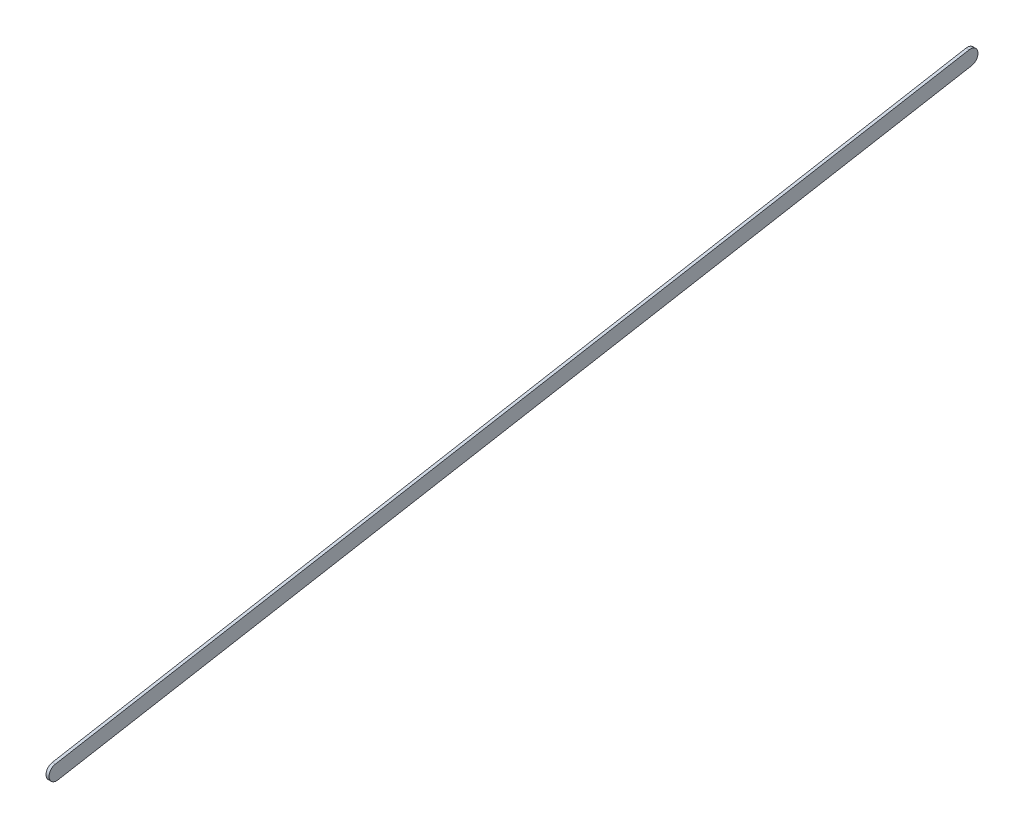
ISO-10303-21;
HEADER;
FILE_DESCRIPTION(('STEP AP214'),'2;1');
FILE_NAME('part.step','',(''),(''),'','','');
FILE_SCHEMA(('AUTOMOTIVE_DESIGN { 1 0 10303 214 1 1 1 1 }'));
ENDSEC;
DATA;
#1=APPLICATION_CONTEXT('core data for automotive mechanical design processes');
#2=APPLICATION_PROTOCOL_DEFINITION('international standard','automotive_design',2000,#1);
#3=PRODUCT_CONTEXT('',#1,'mechanical');
#4=PRODUCT('Part','Part','',(#3));
#5=PRODUCT_RELATED_PRODUCT_CATEGORY('part','',(#4));
#6=PRODUCT_DEFINITION_FORMATION('','',#4);
#7=PRODUCT_DEFINITION_CONTEXT('part definition',#1,'design');
#8=PRODUCT_DEFINITION('design','',#6,#7);
#9=PRODUCT_DEFINITION_SHAPE('','',#8);
#10=(LENGTH_UNIT() NAMED_UNIT(*) SI_UNIT(.MILLI.,.METRE.));
#11=(NAMED_UNIT(*) PLANE_ANGLE_UNIT() SI_UNIT($,.RADIAN.));
#12=(NAMED_UNIT(*) SI_UNIT($,.STERADIAN.) SOLID_ANGLE_UNIT());
#13=UNCERTAINTY_MEASURE_WITH_UNIT(LENGTH_MEASURE(1.E-05),#10,'distance_accuracy_value','');
#14=(GEOMETRIC_REPRESENTATION_CONTEXT(3) GLOBAL_UNCERTAINTY_ASSIGNED_CONTEXT((#13)) GLOBAL_UNIT_ASSIGNED_CONTEXT((#10,
#11,#12)) REPRESENTATION_CONTEXT('',''));
#15=CARTESIAN_POINT('',(0.,0.,0.));
#16=DIRECTION('',(0.,0.,1.));
#17=DIRECTION('',(1.,0.,0.));
#18=AXIS2_PLACEMENT_3D('',#15,#16,#17);
#19=CARTESIAN_POINT('',(3.,0.,0.));
#20=DIRECTION('',(-1.,0.,0.));
#21=DIRECTION('',(0.,0.,1.));
#22=AXIS2_PLACEMENT_3D('',#19,#20,#21);
#23=CYLINDRICAL_SURFACE('',#22,7.5);
#24=CARTESIAN_POINT('',(0.,0.,0.));
#25=DIRECTION('',(1.,0.,0.));
#26=DIRECTION('',(0.,0.,-1.));
#27=AXIS2_PLACEMENT_3D('',#24,#25,#26);
#28=CIRCLE('',#27,7.5);
#29=CARTESIAN_POINT('',(0.,-7.38521780470506,-1.30711819552302));
#30=VERTEX_POINT('',#29);
#31=CARTESIAN_POINT('',(0.,7.38521780470506,1.30711819552302));
#32=VERTEX_POINT('',#31);
#33=EDGE_CURVE('E100',#30,#32,#28,.T.);
#34=ORIENTED_EDGE('',*,*,#33,.T.);
#35=DIRECTION('',(-1.,0.,0.));
#36=VECTOR('',#35,1.);
#37=CARTESIAN_POINT('',(3.,7.38521780470506,1.30711819552302));
#38=LINE('',#37,#36);
#39=CARTESIAN_POINT('',(3.,7.38521780470506,1.30711819552302));
#40=VERTEX_POINT('',#39);
#41=EDGE_CURVE('E11',#40,#32,#38,.T.);
#42=ORIENTED_EDGE('',*,*,#41,.F.);
#43=CARTESIAN_POINT('',(3.,0.,0.));
#44=DIRECTION('',(1.,0.,0.));
#45=DIRECTION('',(0.,0.,-1.));
#46=AXIS2_PLACEMENT_3D('',#43,#44,#45);
#47=CIRCLE('',#46,7.5);
#48=CARTESIAN_POINT('',(3.,-7.38521780470506,-1.30711819552302));
#49=VERTEX_POINT('',#48);
#50=EDGE_CURVE('E88',#49,#40,#47,.T.);
#51=ORIENTED_EDGE('',*,*,#50,.F.);
#52=DIRECTION('',(-1.,0.,0.));
#53=VECTOR('',#52,1.);
#54=CARTESIAN_POINT('',(3.,-7.38521780470506,-1.30711819552302));
#55=LINE('',#54,#53);
#56=EDGE_CURVE('E96',#49,#30,#55,.T.);
#57=ORIENTED_EDGE('',*,*,#56,.T.);
#58=EDGE_LOOP('',(#34,#42,#51,#57));
#59=FACE_BOUND('',#58,.T.);
#60=ADVANCED_FACE('F37',(#59),#23,.T.);
#61=CARTESIAN_POINT('',(3.,7.38521780470506,1.30711819552302));
#62=DIRECTION('',(0.,-0.984695707294008,-0.174282426069736));
#63=DIRECTION('',(0.,0.174282426069736,-0.984695707294008));
#64=AXIS2_PLACEMENT_3D('',#61,#62,#63);
#65=PLANE('',#64);
#66=DIRECTION('',(0.,-0.174282426069736,0.984695707294008));
#67=VECTOR('',#66,1.);
#68=CARTESIAN_POINT('',(0.,7.38521780470506,1.30711819552302));
#69=LINE('',#68,#67);
#70=CARTESIAN_POINT('',(0.,-152.083202049103,902.303690369541));
#71=VERTEX_POINT('',#70);
#72=EDGE_CURVE('E92',#32,#71,#69,.T.);
#73=ORIENTED_EDGE('',*,*,#72,.T.);
#74=DIRECTION('',(-1.,0.,0.));
#75=VECTOR('',#74,1.);
#76=CARTESIAN_POINT('',(3.,-152.083202049103,902.303690369541));
#77=LINE('',#76,#75);
#78=CARTESIAN_POINT('',(3.,-152.083202049103,902.303690369541));
#79=VERTEX_POINT('',#78);
#80=EDGE_CURVE('E45',#79,#71,#77,.T.);
#81=ORIENTED_EDGE('',*,*,#80,.F.);
#82=DIRECTION('',(0.,-0.174282426069736,0.984695707294008));
#83=VECTOR('',#82,1.);
#84=CARTESIAN_POINT('',(3.,7.38521780470506,1.30711819552302));
#85=LINE('',#84,#83);
#86=EDGE_CURVE('E83',#40,#79,#85,.T.);
#87=ORIENTED_EDGE('',*,*,#86,.F.);
#88=ORIENTED_EDGE('',*,*,#41,.T.);
#89=EDGE_LOOP('',(#73,#81,#87,#88));
#90=FACE_BOUND('',#89,.T.);
#91=ADVANCED_FACE('F91',(#90),#65,.F.);
#92=CARTESIAN_POINT('',(3.,-159.468419853808,900.996572174017));
#93=DIRECTION('',(-1.,0.,0.));
#94=DIRECTION('',(0.,0.,1.));
#95=AXIS2_PLACEMENT_3D('',#92,#93,#94);
#96=CYLINDRICAL_SURFACE('',#95,7.49999999999998);
#97=CARTESIAN_POINT('',(0.,-159.468419853808,900.996572174017));
#98=DIRECTION('',(1.,0.,0.));
#99=DIRECTION('',(0.,0.,-1.));
#100=AXIS2_PLACEMENT_3D('',#97,#98,#99);
#101=CIRCLE('',#100,7.49999999999998);
#102=CARTESIAN_POINT('',(0.,-166.853637658513,899.689453978494));
#103=VERTEX_POINT('',#102);
#104=EDGE_CURVE('E70',#71,#103,#101,.T.);
#105=ORIENTED_EDGE('',*,*,#104,.T.);
#106=DIRECTION('',(-1.,0.,0.));
#107=VECTOR('',#106,1.);
#108=CARTESIAN_POINT('',(3.,-166.853637658513,899.689453978494));
#109=LINE('',#108,#107);
#110=CARTESIAN_POINT('',(3.,-166.853637658513,899.689453978494));
#111=VERTEX_POINT('',#110);
#112=EDGE_CURVE('E93',#111,#103,#109,.T.);
#113=ORIENTED_EDGE('',*,*,#112,.F.);
#114=CARTESIAN_POINT('',(3.,-159.468419853808,900.996572174017));
#115=DIRECTION('',(1.,0.,0.));
#116=DIRECTION('',(0.,0.,-1.));
#117=AXIS2_PLACEMENT_3D('',#114,#115,#116);
#118=CIRCLE('',#117,7.49999999999998);
#119=EDGE_CURVE('E86',#79,#111,#118,.T.);
#120=ORIENTED_EDGE('',*,*,#119,.F.);
#121=ORIENTED_EDGE('',*,*,#80,.T.);
#122=EDGE_LOOP('',(#105,#113,#120,#121));
#123=FACE_BOUND('',#122,.T.);
#124=ADVANCED_FACE('F94',(#123),#96,.T.);
#125=CARTESIAN_POINT('',(3.,-7.38521780470506,-1.30711819552302));
#126=DIRECTION('',(0.,0.984695707294008,0.174282426069736));
#127=DIRECTION('',(0.,-0.174282426069736,0.984695707294008));
#128=AXIS2_PLACEMENT_3D('',#125,#126,#127);
#129=PLANE('',#128);
#130=DIRECTION('',(0.,0.174282426069736,-0.984695707294008));
#131=VECTOR('',#130,1.);
#132=CARTESIAN_POINT('',(0.,-7.38521780470506,-1.30711819552302));
#133=LINE('',#132,#131);
#134=EDGE_CURVE('E76',#103,#30,#133,.T.);
#135=ORIENTED_EDGE('',*,*,#134,.T.);
#136=ORIENTED_EDGE('',*,*,#56,.F.);
#137=DIRECTION('',(0.,0.174282426069736,-0.984695707294008));
#138=VECTOR('',#137,1.);
#139=CARTESIAN_POINT('',(3.,-7.38521780470506,-1.30711819552302));
#140=LINE('',#139,#138);
#141=EDGE_CURVE('E53',#111,#49,#140,.T.);
#142=ORIENTED_EDGE('',*,*,#141,.F.);
#143=ORIENTED_EDGE('',*,*,#112,.T.);
#144=EDGE_LOOP('',(#135,#136,#142,#143));
#145=FACE_BOUND('',#144,.T.);
#146=ADVANCED_FACE('F107',(#145),#129,.F.);
#147=CARTESIAN_POINT('',(3.,0.,0.));
#148=DIRECTION('',(1.,0.,0.));
#149=DIRECTION('',(0.,0.,-1.));
#150=AXIS2_PLACEMENT_3D('',#147,#148,#149);
#151=PLANE('',#150);
#152=ORIENTED_EDGE('',*,*,#50,.T.);
#153=ORIENTED_EDGE('',*,*,#86,.T.);
#154=ORIENTED_EDGE('',*,*,#119,.T.);
#155=ORIENTED_EDGE('',*,*,#141,.T.);
#156=EDGE_LOOP('',(#152,#153,#154,#155));
#157=FACE_BOUND('',#156,.T.);
#158=ADVANCED_FACE('F84',(#157),#151,.T.);
#159=CARTESIAN_POINT('',(0.,0.,0.));
#160=DIRECTION('',(1.,0.,0.));
#161=DIRECTION('',(0.,0.,-1.));
#162=AXIS2_PLACEMENT_3D('',#159,#160,#161);
#163=PLANE('',#162);
#164=ORIENTED_EDGE('',*,*,#33,.F.);
#165=ORIENTED_EDGE('',*,*,#134,.F.);
#166=ORIENTED_EDGE('',*,*,#104,.F.);
#167=ORIENTED_EDGE('',*,*,#72,.F.);
#168=EDGE_LOOP('',(#164,#165,#166,#167));
#169=FACE_BOUND('',#168,.T.);
#170=ADVANCED_FACE('F110',(#169),#163,.F.);
#171=CLOSED_SHELL('',(#60,#91,#124,#146,#158,#170));
#172=MANIFOLD_SOLID_BREP('B2',#171);
#173=ADVANCED_BREP_SHAPE_REPRESENTATION('',(#18,#172),#14);
#174=SHAPE_DEFINITION_REPRESENTATION(#9,#173);
ENDSEC;
END-ISO-10303-21;
